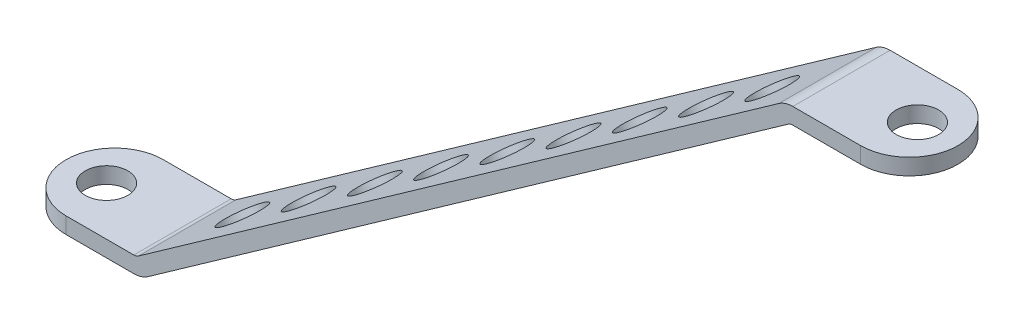
ISO-10303-21;
HEADER;
FILE_DESCRIPTION(('STEP AP214'),'2;1');
FILE_NAME('part.step','',(''),(''),'','','');
FILE_SCHEMA(('AUTOMOTIVE_DESIGN { 1 0 10303 214 1 1 1 1 }'));
ENDSEC;
DATA;
#1=APPLICATION_CONTEXT('core data for automotive mechanical design processes');
#2=APPLICATION_PROTOCOL_DEFINITION('international standard','automotive_design',2000,#1);
#3=PRODUCT_CONTEXT('',#1,'mechanical');
#4=PRODUCT('Part','Part','',(#3));
#5=PRODUCT_RELATED_PRODUCT_CATEGORY('part','',(#4));
#6=PRODUCT_DEFINITION_FORMATION('','',#4);
#7=PRODUCT_DEFINITION_CONTEXT('part definition',#1,'design');
#8=PRODUCT_DEFINITION('design','',#6,#7);
#9=PRODUCT_DEFINITION_SHAPE('','',#8);
#10=(LENGTH_UNIT() NAMED_UNIT(*) SI_UNIT(.MILLI.,.METRE.));
#11=(NAMED_UNIT(*) PLANE_ANGLE_UNIT() SI_UNIT($,.RADIAN.));
#12=(NAMED_UNIT(*) SI_UNIT($,.STERADIAN.) SOLID_ANGLE_UNIT());
#13=UNCERTAINTY_MEASURE_WITH_UNIT(LENGTH_MEASURE(1.E-05),#10,'distance_accuracy_value','');
#14=(GEOMETRIC_REPRESENTATION_CONTEXT(3) GLOBAL_UNCERTAINTY_ASSIGNED_CONTEXT((#13)) GLOBAL_UNIT_ASSIGNED_CONTEXT((#10,
#11,#12)) REPRESENTATION_CONTEXT('',''));
#15=CARTESIAN_POINT('',(0.,0.,0.));
#16=DIRECTION('',(0.,0.,1.));
#17=DIRECTION('',(1.,0.,0.));
#18=AXIS2_PLACEMENT_3D('',#15,#16,#17);
#19=CARTESIAN_POINT('',(76.5080363234849,44.4,4.8));
#20=DIRECTION('',(0.,1.,0.));
#21=DIRECTION('',(-1.,0.,0.));
#22=AXIS2_PLACEMENT_3D('',#19,#20,#21);
#23=PLANE('',#22);
#24=CARTESIAN_POINT('',(84.,44.4,0.));
#25=DIRECTION('',(0.,1.,0.));
#26=DIRECTION('',(-1.,0.,0.));
#27=AXIS2_PLACEMENT_3D('',#24,#25,#26);
#28=CIRCLE('',#27,2.1);
#29=CARTESIAN_POINT('',(84.,44.4,2.1));
#30=VERTEX_POINT('',#29);
#31=EDGE_CURVE('E239',#30,#30,#28,.T.);
#32=ORIENTED_EDGE('',*,*,#31,.T.);
#33=EDGE_LOOP('',(#32));
#34=FACE_BOUND('',#33,.T.);
#35=DIRECTION('',(0.,0.,-1.));
#36=VECTOR('',#35,1.);
#37=CARTESIAN_POINT('',(76.5080363234849,44.4,4.8));
#38=LINE('',#37,#36);
#39=CARTESIAN_POINT('',(76.5080363234849,44.4,4.8));
#40=VERTEX_POINT('',#39);
#41=CARTESIAN_POINT('',(76.5080363234849,44.4,-4.8));
#42=VERTEX_POINT('',#41);
#43=EDGE_CURVE('E277',#40,#42,#38,.T.);
#44=ORIENTED_EDGE('',*,*,#43,.T.);
#45=DIRECTION('',(1.,0.,0.));
#46=VECTOR('',#45,1.);
#47=CARTESIAN_POINT('',(76.5080363234849,44.4,-4.8));
#48=LINE('',#47,#46);
#49=CARTESIAN_POINT('',(83.2,44.4,-4.8));
#50=VERTEX_POINT('',#49);
#51=EDGE_CURVE('E175',#42,#50,#48,.T.);
#52=ORIENTED_EDGE('',*,*,#51,.T.);
#53=CARTESIAN_POINT('',(83.2,44.4,0.));
#54=DIRECTION('',(0.,1.,0.));
#55=DIRECTION('',(-1.,0.,0.));
#56=AXIS2_PLACEMENT_3D('',#53,#54,#55);
#57=CIRCLE('',#56,4.8);
#58=CARTESIAN_POINT('',(83.2,44.4,4.8));
#59=VERTEX_POINT('',#58);
#60=EDGE_CURVE('E307',#50,#59,#57,.F.);
#61=ORIENTED_EDGE('',*,*,#60,.T.);
#62=DIRECTION('',(1.,0.,0.));
#63=VECTOR('',#62,1.);
#64=CARTESIAN_POINT('',(76.5080363234849,44.4,4.8));
#65=LINE('',#64,#63);
#66=EDGE_CURVE('E247',#40,#59,#65,.T.);
#67=ORIENTED_EDGE('',*,*,#66,.F.);
#68=EDGE_LOOP('',(#44,#52,#61,#67));
#69=FACE_BOUND('',#68,.T.);
#70=ADVANCED_FACE('F47',(#34,#69),#23,.F.);
#71=CARTESIAN_POINT('',(76.5080363234849,46.,4.8));
#72=DIRECTION('',(0.,1.,0.));
#73=DIRECTION('',(-1.,0.,0.));
#74=AXIS2_PLACEMENT_3D('',#71,#72,#73);
#75=PLANE('',#74);
#76=CARTESIAN_POINT('',(84.,46.,0.));
#77=DIRECTION('',(0.,1.,0.));
#78=DIRECTION('',(-1.,0.,0.));
#79=AXIS2_PLACEMENT_3D('',#76,#77,#78);
#80=CIRCLE('',#79,2.1);
#81=CARTESIAN_POINT('',(84.,46.,2.1));
#82=VERTEX_POINT('',#81);
#83=EDGE_CURVE('E156',#82,#82,#80,.T.);
#84=ORIENTED_EDGE('',*,*,#83,.F.);
#85=EDGE_LOOP('',(#84));
#86=FACE_BOUND('',#85,.T.);
#87=DIRECTION('',(1.,0.,0.));
#88=VECTOR('',#87,1.);
#89=CARTESIAN_POINT('',(76.5080363234849,46.,4.8));
#90=LINE('',#89,#88);
#91=CARTESIAN_POINT('',(76.5080363234849,46.,4.8));
#92=VERTEX_POINT('',#91);
#93=CARTESIAN_POINT('',(83.2,46.,4.8));
#94=VERTEX_POINT('',#93);
#95=EDGE_CURVE('E252',#92,#94,#90,.T.);
#96=ORIENTED_EDGE('',*,*,#95,.T.);
#97=CARTESIAN_POINT('',(83.2,46.,0.));
#98=DIRECTION('',(0.,1.,0.));
#99=DIRECTION('',(-1.,0.,0.));
#100=AXIS2_PLACEMENT_3D('',#97,#98,#99);
#101=CIRCLE('',#100,4.8);
#102=CARTESIAN_POINT('',(83.2,46.,-4.8));
#103=VERTEX_POINT('',#102);
#104=EDGE_CURVE('E173',#94,#103,#101,.T.);
#105=ORIENTED_EDGE('',*,*,#104,.T.);
#106=DIRECTION('',(1.,0.,0.));
#107=VECTOR('',#106,1.);
#108=CARTESIAN_POINT('',(76.5080363234849,46.,-4.8));
#109=LINE('',#108,#107);
#110=CARTESIAN_POINT('',(76.5080363234849,46.,-4.8));
#111=VERTEX_POINT('',#110);
#112=EDGE_CURVE('E165',#111,#103,#109,.T.);
#113=ORIENTED_EDGE('',*,*,#112,.F.);
#114=DIRECTION('',(0.,0.,-1.));
#115=VECTOR('',#114,1.);
#116=CARTESIAN_POINT('',(76.5080363234849,46.,4.8));
#117=LINE('',#116,#115);
#118=EDGE_CURVE('E147',#92,#111,#117,.T.);
#119=ORIENTED_EDGE('',*,*,#118,.F.);
#120=EDGE_LOOP('',(#96,#105,#113,#119));
#121=FACE_BOUND('',#120,.T.);
#122=ADVANCED_FACE('F171',(#86,#121),#75,.T.);
#123=CARTESIAN_POINT('',(76.5080363234849,43.6,4.8));
#124=DIRECTION('',(0.,0.,-1.));
#125=DIRECTION('',(-1.,0.,0.));
#126=AXIS2_PLACEMENT_3D('',#123,#124,#125);
#127=CYLINDRICAL_SURFACE('',#126,2.4);
#128=ORIENTED_EDGE('',*,*,#118,.T.);
#129=CARTESIAN_POINT('',(76.5080363234849,43.6,-4.8));
#130=DIRECTION('',(0.,0.,1.));
#131=DIRECTION('',(1.,0.,0.));
#132=AXIS2_PLACEMENT_3D('',#129,#130,#131);
#133=CIRCLE('',#132,2.4);
#134=CARTESIAN_POINT('',(75.1235156499759,45.5603832545261,-4.8));
#135=VERTEX_POINT('',#134);
#136=EDGE_CURVE('E150',#135,#111,#133,.F.);
#137=ORIENTED_EDGE('',*,*,#136,.F.);
#138=DIRECTION('',(0.,0.,-1.));
#139=VECTOR('',#138,1.);
#140=CARTESIAN_POINT('',(75.1235156499759,45.5603832545261,4.8));
#141=LINE('',#140,#139);
#142=CARTESIAN_POINT('',(75.1235156499759,45.5603832545261,4.8));
#143=VERTEX_POINT('',#142);
#144=EDGE_CURVE('E157',#143,#135,#141,.T.);
#145=ORIENTED_EDGE('',*,*,#144,.F.);
#146=CARTESIAN_POINT('',(76.5080363234849,43.6,4.8));
#147=DIRECTION('',(0.,0.,1.));
#148=DIRECTION('',(1.,0.,0.));
#149=AXIS2_PLACEMENT_3D('',#146,#147,#148);
#150=CIRCLE('',#149,2.4);
#151=EDGE_CURVE('E152',#143,#92,#150,.F.);
#152=ORIENTED_EDGE('',*,*,#151,.T.);
#153=EDGE_LOOP('',(#128,#137,#145,#152));
#154=FACE_BOUND('',#153,.T.);
#155=ADVANCED_FACE('F149',(#154),#127,.T.);
#156=CARTESIAN_POINT('',(11.9534705676848,0.946538915157986,4.8));
#157=DIRECTION('',(-0.576883613962092,0.816826356052519,0.));
#158=DIRECTION('',(-0.816826356052519,-0.576883613962092,0.));
#159=AXIS2_PLACEMENT_3D('',#156,#157,#158);
#160=PLANE('',#159);
#161=CARTESIAN_POINT('',(23.9346605635699,9.40825434975182,0.));
#162=DIRECTION('',(-0.576883613962092,0.816826356052519,0.));
#163=DIRECTION('',(-0.816826356052519,-0.576883613962092,0.));
#164=AXIS2_PLACEMENT_3D('',#161,#162,#163);
#165=CIRCLE('',#164,2.1);
#166=CARTESIAN_POINT('',(22.2193252158596,8.19679876043142,0.));
#167=VERTEX_POINT('',#166);
#168=EDGE_CURVE('E211',#167,#167,#165,.T.);
#169=ORIENTED_EDGE('',*,*,#168,.F.);
#170=EDGE_LOOP('',(#169));
#171=FACE_BOUND('',#170,.T.);
#172=CARTESIAN_POINT('',(30.46927141199,14.0233232614485,0.));
#173=DIRECTION('',(-0.576883613962092,0.816826356052519,0.));
#174=DIRECTION('',(-0.816826356052519,-0.576883613962092,0.));
#175=AXIS2_PLACEMENT_3D('',#172,#173,#174);
#176=CIRCLE('',#175,2.1);
#177=CARTESIAN_POINT('',(28.7539360642797,12.8118676721282,0.));
#178=VERTEX_POINT('',#177);
#179=EDGE_CURVE('E215',#178,#178,#176,.T.);
#180=ORIENTED_EDGE('',*,*,#179,.F.);
#181=EDGE_LOOP('',(#180));
#182=FACE_BOUND('',#181,.T.);
#183=CARTESIAN_POINT('',(37.0038822604102,18.6383921731453,0.));
#184=DIRECTION('',(-0.576883613962092,0.816826356052519,0.));
#185=DIRECTION('',(-0.816826356052519,-0.576883613962092,0.));
#186=AXIS2_PLACEMENT_3D('',#183,#184,#185);
#187=CIRCLE('',#186,2.1);
#188=CARTESIAN_POINT('',(35.2885469126999,17.4269365838249,0.));
#189=VERTEX_POINT('',#188);
#190=EDGE_CURVE('E218',#189,#189,#187,.T.);
#191=ORIENTED_EDGE('',*,*,#190,.F.);
#192=EDGE_LOOP('',(#191));
#193=FACE_BOUND('',#192,.T.);
#194=CARTESIAN_POINT('',(43.5384931088303,23.253461084842,0.));
#195=DIRECTION('',(-0.576883613962092,0.816826356052519,0.));
#196=DIRECTION('',(-0.816826356052519,-0.576883613962092,0.));
#197=AXIS2_PLACEMENT_3D('',#194,#195,#196);
#198=CIRCLE('',#197,2.1);
#199=CARTESIAN_POINT('',(41.82315776112,22.0420054955216,0.));
#200=VERTEX_POINT('',#199);
#201=EDGE_CURVE('E236',#200,#200,#198,.T.);
#202=ORIENTED_EDGE('',*,*,#201,.F.);
#203=EDGE_LOOP('',(#202));
#204=FACE_BOUND('',#203,.T.);
#205=ORIENTED_EDGE('',*,*,#144,.T.);
#206=DIRECTION('',(0.816826356052519,0.576883613962092,0.));
#207=VECTOR('',#206,1.);
#208=CARTESIAN_POINT('',(11.9534705676848,0.946538915157986,-4.8));
#209=LINE('',#208,#207);
#210=CARTESIAN_POINT('',(11.9534705676848,0.946538915157986,-4.8));
#211=VERTEX_POINT('',#210);
#212=EDGE_CURVE('E168',#211,#135,#209,.T.);
#213=ORIENTED_EDGE('',*,*,#212,.F.);
#214=DIRECTION('',(0.,0.,-1.));
#215=VECTOR('',#214,1.);
#216=CARTESIAN_POINT('',(11.9534705676848,0.946538915157986,4.8));
#217=LINE('',#216,#215);
#218=CARTESIAN_POINT('',(11.9534705676848,0.946538915157986,4.8));
#219=VERTEX_POINT('',#218);
#220=EDGE_CURVE('E292',#219,#211,#217,.T.);
#221=ORIENTED_EDGE('',*,*,#220,.F.);
#222=DIRECTION('',(0.816826356052519,0.576883613962092,0.));
#223=VECTOR('',#222,1.);
#224=CARTESIAN_POINT('',(11.9534705676848,0.946538915157986,4.8));
#225=LINE('',#224,#223);
#226=EDGE_CURVE('E255',#219,#143,#225,.T.);
#227=ORIENTED_EDGE('',*,*,#226,.T.);
#228=EDGE_LOOP('',(#205,#213,#221,#227));
#229=FACE_BOUND('',#228,.T.);
#230=CARTESIAN_POINT('',(69.6769365025109,41.7137367316289,0.));
#231=DIRECTION('',(-0.576883613962092,0.816826356052519,0.));
#232=DIRECTION('',(-0.816826356052519,-0.576883613962092,0.));
#233=AXIS2_PLACEMENT_3D('',#230,#231,#232);
#234=CIRCLE('',#233,2.1);
#235=CARTESIAN_POINT('',(67.9616011548006,40.5022811423085,0.));
#236=VERTEX_POINT('',#235);
#237=EDGE_CURVE('E221',#236,#236,#234,.T.);
#238=ORIENTED_EDGE('',*,*,#237,.F.);
#239=EDGE_LOOP('',(#238));
#240=FACE_BOUND('',#239,.T.);
#241=CARTESIAN_POINT('',(63.1423256540908,37.0986678199322,0.));
#242=DIRECTION('',(-0.576883613962092,0.816826356052519,0.));
#243=DIRECTION('',(-0.816826356052519,-0.576883613962092,0.));
#244=AXIS2_PLACEMENT_3D('',#241,#242,#243);
#245=CIRCLE('',#244,2.1);
#246=CARTESIAN_POINT('',(61.4269903063805,35.8872122306118,0.));
#247=VERTEX_POINT('',#246);
#248=EDGE_CURVE('E225',#247,#247,#245,.T.);
#249=ORIENTED_EDGE('',*,*,#248,.F.);
#250=EDGE_LOOP('',(#249));
#251=FACE_BOUND('',#250,.T.);
#252=CARTESIAN_POINT('',(56.6077148056706,32.4835989082355,0.));
#253=DIRECTION('',(-0.576883613962092,0.816826356052519,0.));
#254=DIRECTION('',(-0.816826356052519,-0.576883613962092,0.));
#255=AXIS2_PLACEMENT_3D('',#252,#253,#254);
#256=CIRCLE('',#255,2.1);
#257=CARTESIAN_POINT('',(54.8923794579603,31.2721433189151,0.));
#258=VERTEX_POINT('',#257);
#259=EDGE_CURVE('E229',#258,#258,#256,.T.);
#260=ORIENTED_EDGE('',*,*,#259,.F.);
#261=EDGE_LOOP('',(#260));
#262=FACE_BOUND('',#261,.T.);
#263=CARTESIAN_POINT('',(50.0731039572505,27.8685299965388,0.));
#264=DIRECTION('',(-0.576883613962092,0.816826356052519,0.));
#265=DIRECTION('',(-0.816826356052519,-0.576883613962092,0.));
#266=AXIS2_PLACEMENT_3D('',#263,#264,#265);
#267=CIRCLE('',#266,2.1);
#268=CARTESIAN_POINT('',(48.3577686095402,26.6570744072184,0.));
#269=VERTEX_POINT('',#268);
#270=EDGE_CURVE('E233',#269,#269,#267,.T.);
#271=ORIENTED_EDGE('',*,*,#270,.F.);
#272=EDGE_LOOP('',(#271));
#273=FACE_BOUND('',#272,.T.);
#274=CARTESIAN_POINT('',(17.4000497151497,4.79318543805508,0.));
#275=DIRECTION('',(-0.576883613962092,0.816826356052519,0.));
#276=DIRECTION('',(-0.816826356052519,-0.576883613962092,0.));
#277=AXIS2_PLACEMENT_3D('',#274,#275,#276);
#278=CIRCLE('',#277,2.1);
#279=CARTESIAN_POINT('',(15.6847143674394,3.58172984873469,0.));
#280=VERTEX_POINT('',#279);
#281=EDGE_CURVE('E208',#280,#280,#278,.T.);
#282=ORIENTED_EDGE('',*,*,#281,.F.);
#283=EDGE_LOOP('',(#282));
#284=FACE_BOUND('',#283,.T.);
#285=ADVANCED_FACE('F348',(#171,#182,#193,#204,#229,#240,#251,#262,#273,#284),#160,.T.);
#286=CARTESIAN_POINT('',(11.4919636765151,1.6,4.8));
#287=DIRECTION('',(0.,0.,-1.));
#288=DIRECTION('',(-1.,0.,0.));
#289=AXIS2_PLACEMENT_3D('',#286,#287,#288);
#290=CYLINDRICAL_SURFACE('',#289,0.799999999999998);
#291=ORIENTED_EDGE('',*,*,#220,.T.);
#292=CARTESIAN_POINT('',(11.4919636765151,1.6,-4.8));
#293=DIRECTION('',(0.,0.,1.));
#294=DIRECTION('',(1.,0.,0.));
#295=AXIS2_PLACEMENT_3D('',#292,#293,#294);
#296=CIRCLE('',#295,0.799999999999998);
#297=CARTESIAN_POINT('',(11.4919636765151,0.800000000000001,-4.8));
#298=VERTEX_POINT('',#297);
#299=EDGE_CURVE('E182',#298,#211,#296,.T.);
#300=ORIENTED_EDGE('',*,*,#299,.F.);
#301=DIRECTION('',(0.,0.,-1.));
#302=VECTOR('',#301,1.);
#303=CARTESIAN_POINT('',(11.4919636765151,0.800000000000001,4.8));
#304=LINE('',#303,#302);
#305=CARTESIAN_POINT('',(11.4919636765151,0.800000000000001,4.8));
#306=VERTEX_POINT('',#305);
#307=EDGE_CURVE('E289',#306,#298,#304,.T.);
#308=ORIENTED_EDGE('',*,*,#307,.F.);
#309=CARTESIAN_POINT('',(11.4919636765151,1.6,4.8));
#310=DIRECTION('',(0.,0.,1.));
#311=DIRECTION('',(1.,0.,0.));
#312=AXIS2_PLACEMENT_3D('',#309,#310,#311);
#313=CIRCLE('',#312,0.799999999999998);
#314=EDGE_CURVE('E259',#306,#219,#313,.T.);
#315=ORIENTED_EDGE('',*,*,#314,.T.);
#316=EDGE_LOOP('',(#291,#300,#308,#315));
#317=FACE_BOUND('',#316,.T.);
#318=ADVANCED_FACE('F351',(#317),#290,.F.);
#319=CARTESIAN_POINT('',(0.,0.8,4.8));
#320=DIRECTION('',(0.,1.,0.));
#321=DIRECTION('',(0.,0.,1.));
#322=AXIS2_PLACEMENT_3D('',#319,#320,#321);
#323=PLANE('',#322);
#324=ORIENTED_EDGE('',*,*,#307,.T.);
#325=DIRECTION('',(1.,0.,0.));
#326=VECTOR('',#325,1.);
#327=CARTESIAN_POINT('',(0.,0.8,-4.8));
#328=LINE('',#327,#326);
#329=CARTESIAN_POINT('',(4.8,0.8,-4.8));
#330=VERTEX_POINT('',#329);
#331=EDGE_CURVE('E185',#330,#298,#328,.T.);
#332=ORIENTED_EDGE('',*,*,#331,.F.);
#333=CARTESIAN_POINT('',(4.8,0.8,0.));
#334=DIRECTION('',(0.,1.,0.));
#335=DIRECTION('',(0.,0.,1.));
#336=AXIS2_PLACEMENT_3D('',#333,#334,#335);
#337=CIRCLE('',#336,4.8);
#338=CARTESIAN_POINT('',(4.8,0.8,4.8));
#339=VERTEX_POINT('',#338);
#340=EDGE_CURVE('E299',#330,#339,#337,.T.);
#341=ORIENTED_EDGE('',*,*,#340,.T.);
#342=DIRECTION('',(1.,0.,0.));
#343=VECTOR('',#342,1.);
#344=CARTESIAN_POINT('',(0.,0.8,4.8));
#345=LINE('',#344,#343);
#346=EDGE_CURVE('E263',#339,#306,#345,.T.);
#347=ORIENTED_EDGE('',*,*,#346,.T.);
#348=EDGE_LOOP('',(#324,#332,#341,#347));
#349=FACE_BOUND('',#348,.T.);
#350=CARTESIAN_POINT('',(4.,0.8,0.));
#351=DIRECTION('',(0.,1.,0.));
#352=DIRECTION('',(0.,0.,1.));
#353=AXIS2_PLACEMENT_3D('',#350,#351,#352);
#354=CIRCLE('',#353,2.1);
#355=CARTESIAN_POINT('',(4.,0.8,2.1));
#356=VERTEX_POINT('',#355);
#357=EDGE_CURVE('E242',#356,#356,#354,.T.);
#358=ORIENTED_EDGE('',*,*,#357,.F.);
#359=EDGE_LOOP('',(#358));
#360=FACE_BOUND('',#359,.T.);
#361=ADVANCED_FACE('F434',(#349,#360),#323,.T.);
#362=CARTESIAN_POINT('',(0.,-0.8,4.8));
#363=DIRECTION('',(0.,1.,0.));
#364=DIRECTION('',(0.,0.,1.));
#365=AXIS2_PLACEMENT_3D('',#362,#363,#364);
#366=PLANE('',#365);
#367=DIRECTION('',(1.,0.,0.));
#368=VECTOR('',#367,1.);
#369=CARTESIAN_POINT('',(0.,-0.8,-4.8));
#370=LINE('',#369,#368);
#371=CARTESIAN_POINT('',(4.8,-0.8,-4.8));
#372=VERTEX_POINT('',#371);
#373=CARTESIAN_POINT('',(11.4919636765151,-0.799999999999999,-4.8));
#374=VERTEX_POINT('',#373);
#375=EDGE_CURVE('E188',#372,#374,#370,.T.);
#376=ORIENTED_EDGE('',*,*,#375,.T.);
#377=DIRECTION('',(0.,0.,-1.));
#378=VECTOR('',#377,1.);
#379=CARTESIAN_POINT('',(11.4919636765151,-0.799999999999999,4.8));
#380=LINE('',#379,#378);
#381=CARTESIAN_POINT('',(11.4919636765151,-0.799999999999999,4.8));
#382=VERTEX_POINT('',#381);
#383=EDGE_CURVE('E286',#382,#374,#380,.T.);
#384=ORIENTED_EDGE('',*,*,#383,.F.);
#385=DIRECTION('',(1.,0.,0.));
#386=VECTOR('',#385,1.);
#387=CARTESIAN_POINT('',(0.,-0.8,4.8));
#388=LINE('',#387,#386);
#389=CARTESIAN_POINT('',(4.8,-0.8,4.8));
#390=VERTEX_POINT('',#389);
#391=EDGE_CURVE('E266',#390,#382,#388,.T.);
#392=ORIENTED_EDGE('',*,*,#391,.F.);
#393=CARTESIAN_POINT('',(4.8,-0.8,0.));
#394=DIRECTION('',(0.,1.,0.));
#395=DIRECTION('',(0.,0.,1.));
#396=AXIS2_PLACEMENT_3D('',#393,#394,#395);
#397=CIRCLE('',#396,4.8);
#398=EDGE_CURVE('E304',#390,#372,#397,.F.);
#399=ORIENTED_EDGE('',*,*,#398,.T.);
#400=EDGE_LOOP('',(#376,#384,#392,#399));
#401=FACE_BOUND('',#400,.T.);
#402=CARTESIAN_POINT('',(4.,-0.8,0.));
#403=DIRECTION('',(0.,1.,0.));
#404=DIRECTION('',(0.,0.,1.));
#405=AXIS2_PLACEMENT_3D('',#402,#403,#404);
#406=CIRCLE('',#405,2.1);
#407=CARTESIAN_POINT('',(4.,-0.8,2.1));
#408=VERTEX_POINT('',#407);
#409=EDGE_CURVE('E243',#408,#408,#406,.T.);
#410=ORIENTED_EDGE('',*,*,#409,.T.);
#411=EDGE_LOOP('',(#410));
#412=FACE_BOUND('',#411,.T.);
#413=ADVANCED_FACE('F386',(#401,#412),#366,.F.);
#414=CARTESIAN_POINT('',(11.4919636765151,1.6,4.8));
#415=DIRECTION('',(0.,0.,-1.));
#416=DIRECTION('',(-1.,0.,0.));
#417=AXIS2_PLACEMENT_3D('',#414,#415,#416);
#418=CYLINDRICAL_SURFACE('',#417,2.4);
#419=ORIENTED_EDGE('',*,*,#383,.T.);
#420=CARTESIAN_POINT('',(11.4919636765151,1.6,-4.8));
#421=DIRECTION('',(0.,0.,1.));
#422=DIRECTION('',(1.,0.,0.));
#423=AXIS2_PLACEMENT_3D('',#420,#421,#422);
#424=CIRCLE('',#423,2.4);
#425=CARTESIAN_POINT('',(12.8764843500241,-0.360383254526044,-4.8));
#426=VERTEX_POINT('',#425);
#427=EDGE_CURVE('E192',#374,#426,#424,.T.);
#428=ORIENTED_EDGE('',*,*,#427,.T.);
#429=DIRECTION('',(0.,0.,-1.));
#430=VECTOR('',#429,1.);
#431=CARTESIAN_POINT('',(12.8764843500241,-0.360383254526044,4.8));
#432=LINE('',#431,#430);
#433=CARTESIAN_POINT('',(12.8764843500241,-0.360383254526044,4.8));
#434=VERTEX_POINT('',#433);
#435=EDGE_CURVE('E283',#434,#426,#432,.T.);
#436=ORIENTED_EDGE('',*,*,#435,.F.);
#437=CARTESIAN_POINT('',(11.4919636765151,1.6,4.8));
#438=DIRECTION('',(0.,0.,1.));
#439=DIRECTION('',(1.,0.,0.));
#440=AXIS2_PLACEMENT_3D('',#437,#438,#439);
#441=CIRCLE('',#440,2.4);
#442=EDGE_CURVE('E269',#382,#434,#441,.T.);
#443=ORIENTED_EDGE('',*,*,#442,.F.);
#444=EDGE_LOOP('',(#419,#428,#436,#443));
#445=FACE_BOUND('',#444,.T.);
#446=ADVANCED_FACE('F377',(#445),#418,.T.);
#447=CARTESIAN_POINT('',(12.8764843500241,-0.360383254526044,4.8));
#448=DIRECTION('',(-0.576883613962092,0.816826356052519,0.));
#449=DIRECTION('',(-0.816826356052519,-0.576883613962092,0.));
#450=AXIS2_PLACEMENT_3D('',#447,#448,#449);
#451=PLANE('',#450);
#452=CARTESIAN_POINT('',(24.8576743459092,8.10133218006779,0.));
#453=DIRECTION('',(-0.576883613962092,0.816826356052519,0.));
#454=DIRECTION('',(-0.816826356052519,-0.576883613962092,0.));
#455=AXIS2_PLACEMENT_3D('',#452,#453,#454);
#456=CIRCLE('',#455,2.1);
#457=CARTESIAN_POINT('',(23.1423389981989,6.8898765907474,0.));
#458=VERTEX_POINT('',#457);
#459=EDGE_CURVE('E55',#458,#458,#456,.T.);
#460=ORIENTED_EDGE('',*,*,#459,.T.);
#461=EDGE_LOOP('',(#460));
#462=FACE_BOUND('',#461,.T.);
#463=CARTESIAN_POINT('',(31.3922851943294,12.7164010917645,0.));
#464=DIRECTION('',(-0.576883613962092,0.816826356052519,0.));
#465=DIRECTION('',(-0.816826356052519,-0.576883613962092,0.));
#466=AXIS2_PLACEMENT_3D('',#463,#464,#465);
#467=CIRCLE('',#466,2.1);
#468=CARTESIAN_POINT('',(29.6769498466191,11.5049455024441,0.));
#469=VERTEX_POINT('',#468);
#470=EDGE_CURVE('E331',#469,#469,#467,.T.);
#471=ORIENTED_EDGE('',*,*,#470,.T.);
#472=EDGE_LOOP('',(#471));
#473=FACE_BOUND('',#472,.T.);
#474=CARTESIAN_POINT('',(37.9268960427495,17.3314700034613,0.));
#475=DIRECTION('',(-0.576883613962092,0.816826356052519,0.));
#476=DIRECTION('',(-0.816826356052519,-0.576883613962092,0.));
#477=AXIS2_PLACEMENT_3D('',#474,#475,#476);
#478=CIRCLE('',#477,2.1);
#479=CARTESIAN_POINT('',(36.2115606950392,16.1200144141409,0.));
#480=VERTEX_POINT('',#479);
#481=EDGE_CURVE('E328',#480,#480,#478,.T.);
#482=ORIENTED_EDGE('',*,*,#481,.T.);
#483=EDGE_LOOP('',(#482));
#484=FACE_BOUND('',#483,.T.);
#485=CARTESIAN_POINT('',(44.4615068911697,21.946538915158,0.));
#486=DIRECTION('',(-0.576883613962092,0.816826356052519,0.));
#487=DIRECTION('',(-0.816826356052519,-0.576883613962092,0.));
#488=AXIS2_PLACEMENT_3D('',#485,#486,#487);
#489=CIRCLE('',#488,2.1);
#490=CARTESIAN_POINT('',(42.7461715434594,20.7350833258376,0.));
#491=VERTEX_POINT('',#490);
#492=EDGE_CURVE('E310',#491,#491,#489,.T.);
#493=ORIENTED_EDGE('',*,*,#492,.T.);
#494=EDGE_LOOP('',(#493));
#495=FACE_BOUND('',#494,.T.);
#496=DIRECTION('',(0.816826356052519,0.576883613962092,0.));
#497=VECTOR('',#496,1.);
#498=CARTESIAN_POINT('',(12.8764843500241,-0.360383254526044,-4.8));
#499=LINE('',#498,#497);
#500=CARTESIAN_POINT('',(76.0465294323152,44.253461084842,-4.8));
#501=VERTEX_POINT('',#500);
#502=EDGE_CURVE('E196',#426,#501,#499,.T.);
#503=ORIENTED_EDGE('',*,*,#502,.T.);
#504=DIRECTION('',(0.,0.,-1.));
#505=VECTOR('',#504,1.);
#506=CARTESIAN_POINT('',(76.0465294323152,44.253461084842,4.8));
#507=LINE('',#506,#505);
#508=CARTESIAN_POINT('',(76.0465294323152,44.253461084842,4.8));
#509=VERTEX_POINT('',#508);
#510=EDGE_CURVE('E280',#509,#501,#507,.T.);
#511=ORIENTED_EDGE('',*,*,#510,.F.);
#512=DIRECTION('',(0.816826356052519,0.576883613962092,0.));
#513=VECTOR('',#512,1.);
#514=CARTESIAN_POINT('',(12.8764843500241,-0.360383254526044,4.8));
#515=LINE('',#514,#513);
#516=EDGE_CURVE('E272',#434,#509,#515,.T.);
#517=ORIENTED_EDGE('',*,*,#516,.F.);
#518=ORIENTED_EDGE('',*,*,#435,.T.);
#519=EDGE_LOOP('',(#503,#511,#517,#518));
#520=FACE_BOUND('',#519,.T.);
#521=CARTESIAN_POINT('',(70.5999502848503,40.4068145619449,0.));
#522=DIRECTION('',(-0.576883613962092,0.816826356052519,0.));
#523=DIRECTION('',(-0.816826356052519,-0.576883613962092,0.));
#524=AXIS2_PLACEMENT_3D('',#521,#522,#523);
#525=CIRCLE('',#524,2.1);
#526=CARTESIAN_POINT('',(68.88461493714,39.1953589726245,0.));
#527=VERTEX_POINT('',#526);
#528=EDGE_CURVE('E324',#527,#527,#525,.T.);
#529=ORIENTED_EDGE('',*,*,#528,.T.);
#530=EDGE_LOOP('',(#529));
#531=FACE_BOUND('',#530,.T.);
#532=CARTESIAN_POINT('',(64.0653394364301,35.7917456502482,0.));
#533=DIRECTION('',(-0.576883613962092,0.816826356052519,0.));
#534=DIRECTION('',(-0.816826356052519,-0.576883613962092,0.));
#535=AXIS2_PLACEMENT_3D('',#532,#533,#534);
#536=CIRCLE('',#535,2.1);
#537=CARTESIAN_POINT('',(62.3500040887198,34.5802900609278,0.));
#538=VERTEX_POINT('',#537);
#539=EDGE_CURVE('E320',#538,#538,#536,.T.);
#540=ORIENTED_EDGE('',*,*,#539,.T.);
#541=EDGE_LOOP('',(#540));
#542=FACE_BOUND('',#541,.T.);
#543=CARTESIAN_POINT('',(57.53072858801,31.1766767385515,0.));
#544=DIRECTION('',(-0.576883613962092,0.816826356052519,0.));
#545=DIRECTION('',(-0.816826356052519,-0.576883613962092,0.));
#546=AXIS2_PLACEMENT_3D('',#543,#544,#545);
#547=CIRCLE('',#546,2.1);
#548=CARTESIAN_POINT('',(55.8153932402997,29.9652211492311,0.));
#549=VERTEX_POINT('',#548);
#550=EDGE_CURVE('E316',#549,#549,#547,.T.);
#551=ORIENTED_EDGE('',*,*,#550,.T.);
#552=EDGE_LOOP('',(#551));
#553=FACE_BOUND('',#552,.T.);
#554=CARTESIAN_POINT('',(50.9961177395898,26.5616078268547,0.));
#555=DIRECTION('',(-0.576883613962092,0.816826356052519,0.));
#556=DIRECTION('',(-0.816826356052519,-0.576883613962092,0.));
#557=AXIS2_PLACEMENT_3D('',#554,#555,#556);
#558=CIRCLE('',#557,2.1);
#559=CARTESIAN_POINT('',(49.2807823918795,25.3501522375343,0.));
#560=VERTEX_POINT('',#559);
#561=EDGE_CURVE('E313',#560,#560,#558,.T.);
#562=ORIENTED_EDGE('',*,*,#561,.T.);
#563=EDGE_LOOP('',(#562));
#564=FACE_BOUND('',#563,.T.);
#565=CARTESIAN_POINT('',(18.3230634974891,3.48626326837106,0.));
#566=DIRECTION('',(-0.576883613962092,0.816826356052519,0.));
#567=DIRECTION('',(-0.816826356052519,-0.576883613962092,0.));
#568=AXIS2_PLACEMENT_3D('',#565,#566,#567);
#569=CIRCLE('',#568,2.1);
#570=CARTESIAN_POINT('',(16.6077281497788,2.27480767905067,0.));
#571=VERTEX_POINT('',#570);
#572=EDGE_CURVE('E11',#571,#571,#569,.T.);
#573=ORIENTED_EDGE('',*,*,#572,.T.);
#574=EDGE_LOOP('',(#573));
#575=FACE_BOUND('',#574,.T.);
#576=ADVANCED_FACE('F337',(#462,#473,#484,#495,#520,#531,#542,#553,#564,#575),#451,.F.);
#577=CARTESIAN_POINT('',(76.5080363234849,43.6,4.8));
#578=DIRECTION('',(0.,0.,-1.));
#579=DIRECTION('',(-1.,0.,0.));
#580=AXIS2_PLACEMENT_3D('',#577,#578,#579);
#581=CYLINDRICAL_SURFACE('',#580,0.799999999999996);
#582=ORIENTED_EDGE('',*,*,#510,.T.);
#583=CARTESIAN_POINT('',(76.5080363234849,43.6,-4.8));
#584=DIRECTION('',(0.,0.,1.));
#585=DIRECTION('',(1.,0.,0.));
#586=AXIS2_PLACEMENT_3D('',#583,#584,#585);
#587=CIRCLE('',#586,0.799999999999996);
#588=EDGE_CURVE('E200',#501,#42,#587,.F.);
#589=ORIENTED_EDGE('',*,*,#588,.T.);
#590=ORIENTED_EDGE('',*,*,#43,.F.);
#591=CARTESIAN_POINT('',(76.5080363234849,43.6,4.8));
#592=DIRECTION('',(0.,0.,1.));
#593=DIRECTION('',(1.,0.,0.));
#594=AXIS2_PLACEMENT_3D('',#591,#592,#593);
#595=CIRCLE('',#594,0.799999999999996);
#596=EDGE_CURVE('E275',#509,#40,#595,.F.);
#597=ORIENTED_EDGE('',*,*,#596,.F.);
#598=EDGE_LOOP('',(#582,#589,#590,#597));
#599=FACE_BOUND('',#598,.T.);
#600=ADVANCED_FACE('F376',(#599),#581,.F.);
#601=CARTESIAN_POINT('',(76.5080363234849,43.6,4.8));
#602=DIRECTION('',(0.,0.,1.));
#603=DIRECTION('',(1.,0.,0.));
#604=AXIS2_PLACEMENT_3D('',#601,#602,#603);
#605=PLANE('',#604);
#606=ORIENTED_EDGE('',*,*,#346,.F.);
#607=DIRECTION('',(0.,1.,0.));
#608=VECTOR('',#607,1.);
#609=CARTESIAN_POINT('',(4.8,43.6,4.8));
#610=LINE('',#609,#608);
#611=EDGE_CURVE('E65',#339,#390,#610,.F.);
#612=ORIENTED_EDGE('',*,*,#611,.T.);
#613=ORIENTED_EDGE('',*,*,#391,.T.);
#614=ORIENTED_EDGE('',*,*,#442,.T.);
#615=ORIENTED_EDGE('',*,*,#516,.T.);
#616=ORIENTED_EDGE('',*,*,#596,.T.);
#617=ORIENTED_EDGE('',*,*,#66,.T.);
#618=DIRECTION('',(0.,-1.,0.));
#619=VECTOR('',#618,1.);
#620=CARTESIAN_POINT('',(83.2,43.6,4.8));
#621=LINE('',#620,#619);
#622=EDGE_CURVE('E72',#59,#94,#621,.F.);
#623=ORIENTED_EDGE('',*,*,#622,.T.);
#624=ORIENTED_EDGE('',*,*,#95,.F.);
#625=ORIENTED_EDGE('',*,*,#151,.F.);
#626=ORIENTED_EDGE('',*,*,#226,.F.);
#627=ORIENTED_EDGE('',*,*,#314,.F.);
#628=EDGE_LOOP('',(#606,#612,#613,#614,#615,#616,#617,#623,#624,#625,#626,#627));
#629=FACE_BOUND('',#628,.T.);
#630=ADVANCED_FACE('F383',(#629),#605,.T.);
#631=CARTESIAN_POINT('',(4.,-0.8,0.));
#632=DIRECTION('',(0.,1.,0.));
#633=DIRECTION('',(0.,0.,1.));
#634=AXIS2_PLACEMENT_3D('',#631,#632,#633);
#635=CYLINDRICAL_SURFACE('',#634,2.1);
#636=ORIENTED_EDGE('',*,*,#357,.T.);
#637=EDGE_LOOP('',(#636));
#638=FACE_BOUND('',#637,.T.);
#639=ORIENTED_EDGE('',*,*,#409,.F.);
#640=EDGE_LOOP('',(#639));
#641=FACE_BOUND('',#640,.T.);
#642=ADVANCED_FACE('F409',(#638,#641),#635,.F.);
#643=CARTESIAN_POINT('',(84.,-0.800000000000002,0.));
#644=DIRECTION('',(0.,1.,0.));
#645=DIRECTION('',(0.,0.,1.));
#646=AXIS2_PLACEMENT_3D('',#643,#644,#645);
#647=CYLINDRICAL_SURFACE('',#646,2.1);
#648=CARTESIAN_POINT('',(84.,44.4,2.1));
#649=CARTESIAN_POINT('',(84.,44.4166666666667,2.1));
#650=CARTESIAN_POINT('',(84.,44.4333333333333,2.1));
#651=CARTESIAN_POINT('',(84.,44.4666666666667,2.1));
#652=CARTESIAN_POINT('',(84.,44.4833333333333,2.1));
#653=CARTESIAN_POINT('',(84.,44.5166666666667,2.1));
#654=CARTESIAN_POINT('',(84.,44.5333333333333,2.1));
#655=CARTESIAN_POINT('',(84.,44.5666666666667,2.1));
#656=CARTESIAN_POINT('',(84.,44.5833333333333,2.1));
#657=CARTESIAN_POINT('',(84.,44.6166666666667,2.1));
#658=CARTESIAN_POINT('',(84.,44.6333333333333,2.1));
#659=CARTESIAN_POINT('',(84.,44.6666666666667,2.1));
#660=CARTESIAN_POINT('',(84.,44.6833333333333,2.1));
#661=CARTESIAN_POINT('',(84.,44.7166666666667,2.1));
#662=CARTESIAN_POINT('',(84.,44.7333333333333,2.1));
#663=CARTESIAN_POINT('',(84.,44.7666666666667,2.1));
#664=CARTESIAN_POINT('',(84.,44.7833333333333,2.1));
#665=CARTESIAN_POINT('',(84.,44.8166666666667,2.1));
#666=CARTESIAN_POINT('',(84.,44.8333333333333,2.1));
#667=CARTESIAN_POINT('',(84.,44.8666666666667,2.1));
#668=CARTESIAN_POINT('',(84.,44.8833333333333,2.1));
#669=CARTESIAN_POINT('',(84.,44.9166666666667,2.1));
#670=CARTESIAN_POINT('',(84.,44.9333333333333,2.1));
#671=CARTESIAN_POINT('',(84.,44.9666666666667,2.1));
#672=CARTESIAN_POINT('',(84.,44.9833333333333,2.1));
#673=CARTESIAN_POINT('',(84.,45.0166666666667,2.1));
#674=CARTESIAN_POINT('',(84.,45.0333333333333,2.1));
#675=CARTESIAN_POINT('',(84.,45.0666666666667,2.1));
#676=CARTESIAN_POINT('',(84.,45.0833333333333,2.1));
#677=CARTESIAN_POINT('',(84.,45.1166666666667,2.1));
#678=CARTESIAN_POINT('',(84.,45.1333333333333,2.1));
#679=CARTESIAN_POINT('',(84.,45.1666666666667,2.1));
#680=CARTESIAN_POINT('',(84.,45.1833333333333,2.1));
#681=CARTESIAN_POINT('',(84.,45.2166666666667,2.1));
#682=CARTESIAN_POINT('',(84.,45.2333333333333,2.1));
#683=CARTESIAN_POINT('',(84.,45.2666666666667,2.1));
#684=CARTESIAN_POINT('',(84.,45.2833333333333,2.1));
#685=CARTESIAN_POINT('',(84.,45.3166666666667,2.1));
#686=CARTESIAN_POINT('',(84.,45.3333333333333,2.1));
#687=CARTESIAN_POINT('',(84.,45.3666666666667,2.1));
#688=CARTESIAN_POINT('',(84.,45.3833333333333,2.1));
#689=CARTESIAN_POINT('',(84.,45.4166666666667,2.1));
#690=CARTESIAN_POINT('',(84.,45.4333333333333,2.1));
#691=CARTESIAN_POINT('',(84.,45.4666666666667,2.1));
#692=CARTESIAN_POINT('',(84.,45.4833333333333,2.1));
#693=CARTESIAN_POINT('',(84.,45.5166666666667,2.1));
#694=CARTESIAN_POINT('',(84.,45.5333333333333,2.1));
#695=CARTESIAN_POINT('',(84.,45.5666666666667,2.1));
#696=CARTESIAN_POINT('',(84.,45.5833333333333,2.1));
#697=CARTESIAN_POINT('',(84.,45.6166666666667,2.1));
#698=CARTESIAN_POINT('',(84.,45.6333333333333,2.1));
#699=CARTESIAN_POINT('',(84.,45.6666666666667,2.1));
#700=CARTESIAN_POINT('',(84.,45.6833333333333,2.1));
#701=CARTESIAN_POINT('',(84.,45.7166666666667,2.1));
#702=CARTESIAN_POINT('',(84.,45.7333333333333,2.1));
#703=CARTESIAN_POINT('',(84.,45.7666666666667,2.1));
#704=CARTESIAN_POINT('',(84.,45.7833333333333,2.1));
#705=CARTESIAN_POINT('',(84.,45.8166666666667,2.1));
#706=CARTESIAN_POINT('',(84.,45.8333333333333,2.1));
#707=CARTESIAN_POINT('',(84.,45.8666666666667,2.1));
#708=CARTESIAN_POINT('',(84.,45.8833333333333,2.1));
#709=CARTESIAN_POINT('',(84.,45.9166666666667,2.1));
#710=CARTESIAN_POINT('',(84.,45.9333333333333,2.1));
#711=CARTESIAN_POINT('',(84.,45.9666666666667,2.1));
#712=CARTESIAN_POINT('',(84.,45.9833333333333,2.1));
#713=CARTESIAN_POINT('',(84.,46.,2.1));
#714=B_SPLINE_CURVE_WITH_KNOTS('',3,(#648,#649,#650,#651,#652,#653,#654,#655,#656,#657,#658,
#659,#660,#661,#662,#663,#664,#665,#666,#667,#668,#669,#670,#671,#672,#673,#674,#675,#676,#677,
#678,#679,#680,#681,#682,#683,#684,#685,#686,#687,#688,#689,#690,#691,#692,#693,#694,#695,#696,
#697,#698,#699,#700,#701,#702,#703,#704,#705,#706,#707,#708,#709,#710,#711,#712,#713),
.UNSPECIFIED.,.F.,.F.,(4,2,2,2,2,2,2,2,2,2,2,2,2,2,2,2,2,2,2,2,2,2,2,2,2,2,2,2,2,2,2,2,4),(0.,
0.0500000000000014,0.100000000000003,0.149999999999997,0.199999999999999,0.25,0.300000000000002,
0.350000000000003,0.399999999999998,0.449999999999999,0.5,0.550000000000002,0.600000000000003,
0.650000000000005,0.699999999999999,0.750000000000001,0.800000000000002,0.850000000000004,
0.900000000000005,0.95,1.,1.05,1.1,1.15000000000001,1.20000000000001,1.25,1.3,1.35,
1.40000000000001,1.45000000000001,1.5,1.55,1.6),.UNSPECIFIED.);
#715=EDGE_CURVE('BSEAM401',#30,#82,#714,.T.);
#716=ORIENTED_EDGE('',*,*,#31,.F.);
#717=ORIENTED_EDGE('',*,*,#83,.T.);
#718=ORIENTED_EDGE('',*,*,#715,.T.);
#719=ORIENTED_EDGE('',*,*,#715,.F.);
#720=EDGE_LOOP('',(#716,#718,#717,#719));
#721=FACE_BOUND('',#720,.T.);
#722=ADVANCED_FACE('F401',(#721),#647,.F.);
#723=CARTESIAN_POINT('',(4.8,-0.8,0.));
#724=DIRECTION('',(0.,1.,0.));
#725=DIRECTION('',(0.,0.,1.));
#726=AXIS2_PLACEMENT_3D('',#723,#724,#725);
#727=CYLINDRICAL_SURFACE('',#726,4.8);
#728=ORIENTED_EDGE('',*,*,#398,.F.);
#729=ORIENTED_EDGE('',*,*,#611,.F.);
#730=ORIENTED_EDGE('',*,*,#340,.F.);
#731=DIRECTION('',(0.,1.,0.));
#732=VECTOR('',#731,1.);
#733=CARTESIAN_POINT('',(4.8,43.6,-4.8));
#734=LINE('',#733,#732);
#735=EDGE_CURVE('E205',#330,#372,#734,.F.);
#736=ORIENTED_EDGE('',*,*,#735,.T.);
#737=EDGE_LOOP('',(#728,#729,#730,#736));
#738=FACE_BOUND('',#737,.T.);
#739=ADVANCED_FACE('F399',(#738),#727,.T.);
#740=CARTESIAN_POINT('',(83.2,46.,0.));
#741=DIRECTION('',(0.,-1.,0.));
#742=DIRECTION('',(0.,0.,-1.));
#743=AXIS2_PLACEMENT_3D('',#740,#741,#742);
#744=CYLINDRICAL_SURFACE('',#743,4.8);
#745=ORIENTED_EDGE('',*,*,#104,.F.);
#746=ORIENTED_EDGE('',*,*,#622,.F.);
#747=ORIENTED_EDGE('',*,*,#60,.F.);
#748=DIRECTION('',(0.,-1.,0.));
#749=VECTOR('',#748,1.);
#750=CARTESIAN_POINT('',(83.2,43.6,-4.8));
#751=LINE('',#750,#749);
#752=EDGE_CURVE('E203',#50,#103,#751,.F.);
#753=ORIENTED_EDGE('',*,*,#752,.T.);
#754=EDGE_LOOP('',(#745,#746,#747,#753));
#755=FACE_BOUND('',#754,.T.);
#756=ADVANCED_FACE('F49',(#755),#744,.T.);
#757=CARTESIAN_POINT('',(69.6693685006125,-13.7460084964424,0.));
#758=DIRECTION('',(-0.576883613962092,0.816826356052519,0.));
#759=DIRECTION('',(-0.816826356052519,-0.576883613962092,0.));
#760=AXIS2_PLACEMENT_3D('',#757,#758,#759);
#761=CYLINDRICAL_SURFACE('',#760,2.1);
#762=ORIENTED_EDGE('',*,*,#492,.F.);
#763=EDGE_LOOP('',(#762));
#764=FACE_BOUND('',#763,.T.);
#765=ORIENTED_EDGE('',*,*,#201,.T.);
#766=EDGE_LOOP('',(#765));
#767=FACE_BOUND('',#766,.T.);
#768=ADVANCED_FACE('F407',(#764,#767),#761,.F.);
#769=CARTESIAN_POINT('',(76.2039793490326,-9.1309395847457,0.));
#770=DIRECTION('',(-0.576883613962092,0.816826356052519,0.));
#771=DIRECTION('',(-0.816826356052519,-0.576883613962092,0.));
#772=AXIS2_PLACEMENT_3D('',#769,#770,#771);
#773=CYLINDRICAL_SURFACE('',#772,2.1);
#774=ORIENTED_EDGE('',*,*,#270,.T.);
#775=EDGE_LOOP('',(#774));
#776=FACE_BOUND('',#775,.T.);
#777=ORIENTED_EDGE('',*,*,#561,.F.);
#778=EDGE_LOOP('',(#777));
#779=FACE_BOUND('',#778,.T.);
#780=ADVANCED_FACE('F559',(#776,#779),#773,.F.);
#781=CARTESIAN_POINT('',(82.7385901974528,-4.51587067304898,0.));
#782=DIRECTION('',(-0.576883613962092,0.816826356052519,0.));
#783=DIRECTION('',(-0.816826356052519,-0.576883613962092,0.));
#784=AXIS2_PLACEMENT_3D('',#781,#782,#783);
#785=CYLINDRICAL_SURFACE('',#784,2.1);
#786=ORIENTED_EDGE('',*,*,#259,.T.);
#787=EDGE_LOOP('',(#786));
#788=FACE_BOUND('',#787,.T.);
#789=ORIENTED_EDGE('',*,*,#550,.F.);
#790=EDGE_LOOP('',(#789));
#791=FACE_BOUND('',#790,.T.);
#792=ADVANCED_FACE('F571',(#788,#791),#785,.F.);
#793=CARTESIAN_POINT('',(89.2732010458729,0.099198238647763,0.));
#794=DIRECTION('',(-0.576883613962092,0.816826356052519,0.));
#795=DIRECTION('',(-0.816826356052519,-0.576883613962092,0.));
#796=AXIS2_PLACEMENT_3D('',#793,#794,#795);
#797=CYLINDRICAL_SURFACE('',#796,2.1);
#798=ORIENTED_EDGE('',*,*,#248,.T.);
#799=EDGE_LOOP('',(#798));
#800=FACE_BOUND('',#799,.T.);
#801=ORIENTED_EDGE('',*,*,#539,.F.);
#802=EDGE_LOOP('',(#801));
#803=FACE_BOUND('',#802,.T.);
#804=ADVANCED_FACE('F583',(#800,#803),#797,.F.);
#805=CARTESIAN_POINT('',(95.8078118942931,4.71426715034449,0.));
#806=DIRECTION('',(-0.576883613962092,0.816826356052519,0.));
#807=DIRECTION('',(-0.816826356052519,-0.576883613962092,0.));
#808=AXIS2_PLACEMENT_3D('',#805,#806,#807);
#809=CYLINDRICAL_SURFACE('',#808,2.1);
#810=ORIENTED_EDGE('',*,*,#237,.T.);
#811=EDGE_LOOP('',(#810));
#812=FACE_BOUND('',#811,.T.);
#813=ORIENTED_EDGE('',*,*,#528,.F.);
#814=EDGE_LOOP('',(#813));
#815=FACE_BOUND('',#814,.T.);
#816=ADVANCED_FACE('F595',(#812,#815),#809,.F.);
#817=CARTESIAN_POINT('',(63.1347576521923,-18.3610774081392,0.));
#818=DIRECTION('',(-0.576883613962092,0.816826356052519,0.));
#819=DIRECTION('',(-0.816826356052519,-0.576883613962092,0.));
#820=AXIS2_PLACEMENT_3D('',#817,#818,#819);
#821=CYLINDRICAL_SURFACE('',#820,2.1);
#822=ORIENTED_EDGE('',*,*,#481,.F.);
#823=EDGE_LOOP('',(#822));
#824=FACE_BOUND('',#823,.T.);
#825=ORIENTED_EDGE('',*,*,#190,.T.);
#826=EDGE_LOOP('',(#825));
#827=FACE_BOUND('',#826,.T.);
#828=ADVANCED_FACE('F607',(#824,#827),#821,.F.);
#829=CARTESIAN_POINT('',(56.6001468037722,-22.9761463198359,0.));
#830=DIRECTION('',(-0.576883613962092,0.816826356052519,0.));
#831=DIRECTION('',(-0.816826356052519,-0.576883613962092,0.));
#832=AXIS2_PLACEMENT_3D('',#829,#830,#831);
#833=CYLINDRICAL_SURFACE('',#832,2.1);
#834=ORIENTED_EDGE('',*,*,#470,.F.);
#835=EDGE_LOOP('',(#834));
#836=FACE_BOUND('',#835,.T.);
#837=ORIENTED_EDGE('',*,*,#179,.T.);
#838=EDGE_LOOP('',(#837));
#839=FACE_BOUND('',#838,.T.);
#840=ADVANCED_FACE('F344',(#836,#839),#833,.F.);
#841=CARTESIAN_POINT('',(50.065535955352,-27.5912152315326,0.));
#842=DIRECTION('',(-0.576883613962092,0.816826356052519,0.));
#843=DIRECTION('',(-0.816826356052519,-0.576883613962092,0.));
#844=AXIS2_PLACEMENT_3D('',#841,#842,#843);
#845=CYLINDRICAL_SURFACE('',#844,2.1);
#846=ORIENTED_EDGE('',*,*,#459,.F.);
#847=EDGE_LOOP('',(#846));
#848=FACE_BOUND('',#847,.T.);
#849=ORIENTED_EDGE('',*,*,#168,.T.);
#850=EDGE_LOOP('',(#849));
#851=FACE_BOUND('',#850,.T.);
#852=ADVANCED_FACE('F340',(#848,#851),#845,.F.);
#853=CARTESIAN_POINT('',(43.5309251069319,-32.2062841432294,0.));
#854=DIRECTION('',(-0.576883613962092,0.816826356052519,0.));
#855=DIRECTION('',(-0.816826356052519,-0.576883613962092,0.));
#856=AXIS2_PLACEMENT_3D('',#853,#854,#855);
#857=CYLINDRICAL_SURFACE('',#856,2.1);
#858=ORIENTED_EDGE('',*,*,#281,.T.);
#859=EDGE_LOOP('',(#858));
#860=FACE_BOUND('',#859,.T.);
#861=ORIENTED_EDGE('',*,*,#572,.F.);
#862=EDGE_LOOP('',(#861));
#863=FACE_BOUND('',#862,.T.);
#864=ADVANCED_FACE('F343',(#860,#863),#857,.F.);
#865=CARTESIAN_POINT('',(76.5080363234849,43.6,-4.8));
#866=DIRECTION('',(0.,0.,-1.));
#867=DIRECTION('',(1.,0.,0.));
#868=AXIS2_PLACEMENT_3D('',#865,#866,#867);
#869=PLANE('',#868);
#870=ORIENTED_EDGE('',*,*,#331,.T.);
#871=ORIENTED_EDGE('',*,*,#299,.T.);
#872=ORIENTED_EDGE('',*,*,#212,.T.);
#873=ORIENTED_EDGE('',*,*,#136,.T.);
#874=ORIENTED_EDGE('',*,*,#112,.T.);
#875=ORIENTED_EDGE('',*,*,#752,.F.);
#876=ORIENTED_EDGE('',*,*,#51,.F.);
#877=ORIENTED_EDGE('',*,*,#588,.F.);
#878=ORIENTED_EDGE('',*,*,#502,.F.);
#879=ORIENTED_EDGE('',*,*,#427,.F.);
#880=ORIENTED_EDGE('',*,*,#375,.F.);
#881=ORIENTED_EDGE('',*,*,#735,.F.);
#882=EDGE_LOOP('',(#870,#871,#872,#873,#874,#875,#876,#877,#878,#879,#880,#881));
#883=FACE_BOUND('',#882,.T.);
#884=ADVANCED_FACE('F163',(#883),#869,.T.);
#885=CLOSED_SHELL('',(#70,#122,#155,#285,#318,#361,#413,#446,#576,#600,#630,#642,#722,#739,#756,
#768,#780,#792,#804,#816,#828,#840,#852,#864,#884));
#886=MANIFOLD_SOLID_BREP('B2',#885);
#887=ADVANCED_BREP_SHAPE_REPRESENTATION('',(#18,#886),#14);
#888=SHAPE_DEFINITION_REPRESENTATION(#9,#887);
ENDSEC;
END-ISO-10303-21;
